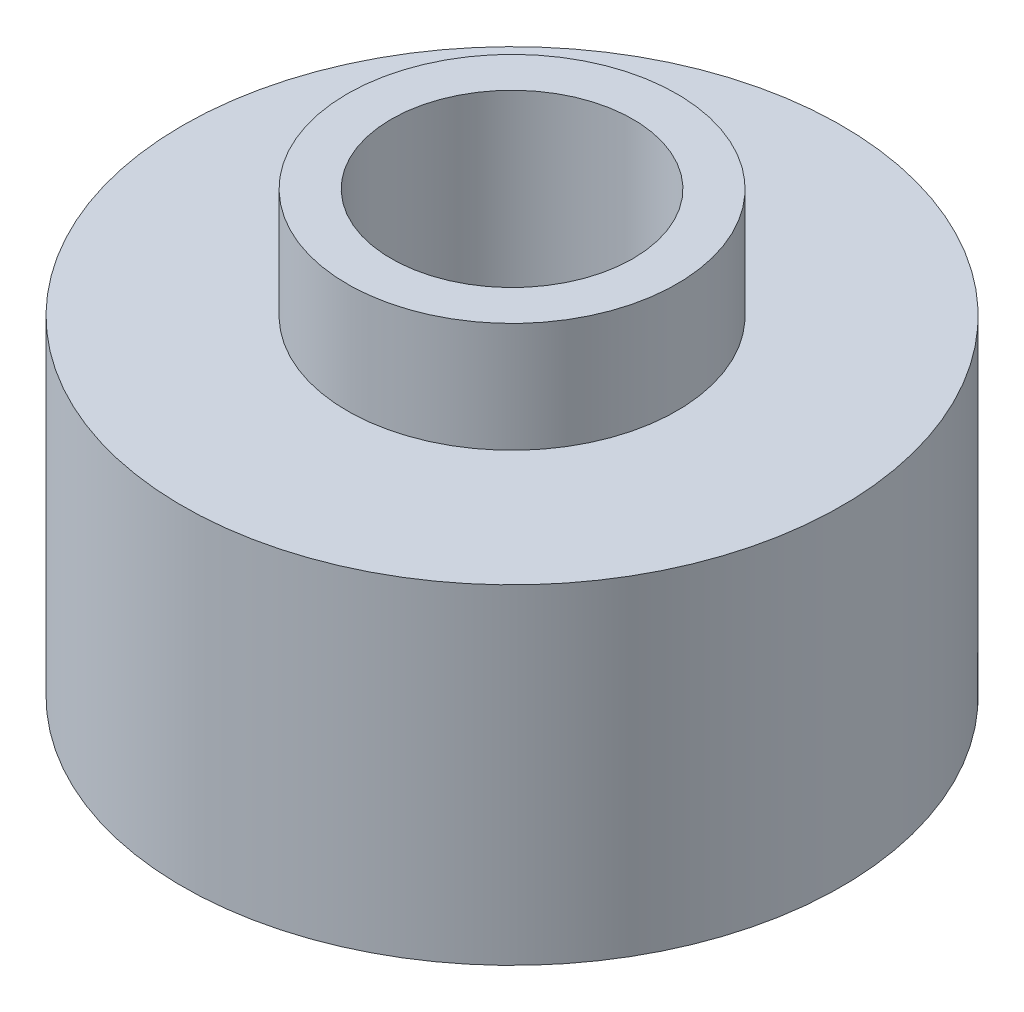
ISO-10303-21;
HEADER;
FILE_DESCRIPTION(('STEP AP214'),'2;1');
FILE_NAME('part.step','',(''),(''),'','','');
FILE_SCHEMA(('AUTOMOTIVE_DESIGN { 1 0 10303 214 1 1 1 1 }'));
ENDSEC;
DATA;
#1=APPLICATION_CONTEXT('core data for automotive mechanical design processes');
#2=APPLICATION_PROTOCOL_DEFINITION('international standard','automotive_design',2000,#1);
#3=PRODUCT_CONTEXT('',#1,'mechanical');
#4=PRODUCT('Part','Part','',(#3));
#5=PRODUCT_RELATED_PRODUCT_CATEGORY('part','',(#4));
#6=PRODUCT_DEFINITION_FORMATION('','',#4);
#7=PRODUCT_DEFINITION_CONTEXT('part definition',#1,'design');
#8=PRODUCT_DEFINITION('design','',#6,#7);
#9=PRODUCT_DEFINITION_SHAPE('','',#8);
#10=(LENGTH_UNIT() NAMED_UNIT(*) SI_UNIT(.MILLI.,.METRE.));
#11=(NAMED_UNIT(*) PLANE_ANGLE_UNIT() SI_UNIT($,.RADIAN.));
#12=(NAMED_UNIT(*) SI_UNIT($,.STERADIAN.) SOLID_ANGLE_UNIT());
#13=UNCERTAINTY_MEASURE_WITH_UNIT(LENGTH_MEASURE(1.E-05),#10,'distance_accuracy_value','');
#14=(GEOMETRIC_REPRESENTATION_CONTEXT(3) GLOBAL_UNCERTAINTY_ASSIGNED_CONTEXT((#13)) GLOBAL_UNIT_ASSIGNED_CONTEXT((#10,
#11,#12)) REPRESENTATION_CONTEXT('',''));
#15=CARTESIAN_POINT('',(0.,0.,0.));
#16=DIRECTION('',(0.,0.,1.));
#17=DIRECTION('',(1.,0.,0.));
#18=AXIS2_PLACEMENT_3D('',#15,#16,#17);
#19=CARTESIAN_POINT('',(0.,0.,0.));
#20=DIRECTION('',(0.,1.,0.));
#21=DIRECTION('',(-1.,0.,0.));
#22=AXIS2_PLACEMENT_3D('',#19,#20,#21);
#23=PLANE('',#22);
#24=CARTESIAN_POINT('',(0.,0.,0.));
#25=DIRECTION('',(0.,1.,0.));
#26=DIRECTION('',(-1.,0.,0.));
#27=AXIS2_PLACEMENT_3D('',#24,#25,#26);
#28=CIRCLE('',#27,3.4925);
#29=CARTESIAN_POINT('',(-3.4925,0.,0.));
#30=VERTEX_POINT('',#29);
#31=EDGE_CURVE('E63',#30,#30,#28,.T.);
#32=ORIENTED_EDGE('',*,*,#31,.T.);
#33=EDGE_LOOP('',(#32));
#34=FACE_BOUND('',#33,.T.);
#35=CARTESIAN_POINT('',(0.,0.,0.));
#36=DIRECTION('',(0.,1.,0.));
#37=DIRECTION('',(-1.,0.,0.));
#38=AXIS2_PLACEMENT_3D('',#35,#36,#37);
#39=CIRCLE('',#38,9.525);
#40=CARTESIAN_POINT('',(-9.525,0.,0.));
#41=VERTEX_POINT('',#40);
#42=EDGE_CURVE('E10',#41,#41,#39,.T.);
#43=ORIENTED_EDGE('',*,*,#42,.F.);
#44=EDGE_LOOP('',(#43));
#45=FACE_BOUND('',#44,.T.);
#46=ADVANCED_FACE('F40',(#34,#45),#23,.F.);
#47=CARTESIAN_POINT('',(0.,12.7,0.));
#48=DIRECTION('',(0.,1.,0.));
#49=DIRECTION('',(-1.,0.,0.));
#50=AXIS2_PLACEMENT_3D('',#47,#48,#49);
#51=CYLINDRICAL_SURFACE('',#50,9.525);
#52=CARTESIAN_POINT('',(0.,9.525,0.));
#53=DIRECTION('',(0.,1.,0.));
#54=DIRECTION('',(-1.,0.,0.));
#55=AXIS2_PLACEMENT_3D('',#52,#53,#54);
#56=CIRCLE('',#55,9.525);
#57=CARTESIAN_POINT('',(-9.525,9.525,0.));
#58=VERTEX_POINT('',#57);
#59=EDGE_CURVE('E47',#58,#58,#56,.T.);
#60=ORIENTED_EDGE('',*,*,#59,.F.);
#61=EDGE_LOOP('',(#60));
#62=FACE_BOUND('',#61,.T.);
#63=ORIENTED_EDGE('',*,*,#42,.T.);
#64=EDGE_LOOP('',(#63));
#65=FACE_BOUND('',#64,.T.);
#66=ADVANCED_FACE('F94',(#62,#65),#51,.T.);
#67=CARTESIAN_POINT('',(9.525,9.525,0.));
#68=DIRECTION('',(0.,-1.,0.));
#69=DIRECTION('',(1.,0.,0.));
#70=AXIS2_PLACEMENT_3D('',#67,#68,#69);
#71=PLANE('',#70);
#72=CARTESIAN_POINT('',(0.,9.525,0.));
#73=DIRECTION('',(0.,1.,0.));
#74=DIRECTION('',(-1.,0.,0.));
#75=AXIS2_PLACEMENT_3D('',#72,#73,#74);
#76=CIRCLE('',#75,4.7625);
#77=CARTESIAN_POINT('',(-4.7625,9.525,0.));
#78=VERTEX_POINT('',#77);
#79=EDGE_CURVE('E52',#78,#78,#76,.T.);
#80=ORIENTED_EDGE('',*,*,#79,.F.);
#81=EDGE_LOOP('',(#80));
#82=FACE_BOUND('',#81,.T.);
#83=ORIENTED_EDGE('',*,*,#59,.T.);
#84=EDGE_LOOP('',(#83));
#85=FACE_BOUND('',#84,.T.);
#86=ADVANCED_FACE('F89',(#82,#85),#71,.F.);
#87=CARTESIAN_POINT('',(0.,12.7,0.));
#88=DIRECTION('',(0.,1.,0.));
#89=DIRECTION('',(-1.,0.,0.));
#90=AXIS2_PLACEMENT_3D('',#87,#88,#89);
#91=CYLINDRICAL_SURFACE('',#90,4.7625);
#92=CARTESIAN_POINT('',(0.,12.7,0.));
#93=DIRECTION('',(0.,1.,0.));
#94=DIRECTION('',(-1.,0.,0.));
#95=AXIS2_PLACEMENT_3D('',#92,#93,#94);
#96=CIRCLE('',#95,4.7625);
#97=CARTESIAN_POINT('',(-4.7625,12.7,0.));
#98=VERTEX_POINT('',#97);
#99=EDGE_CURVE('E57',#98,#98,#96,.T.);
#100=ORIENTED_EDGE('',*,*,#99,.F.);
#101=EDGE_LOOP('',(#100));
#102=FACE_BOUND('',#101,.T.);
#103=ORIENTED_EDGE('',*,*,#79,.T.);
#104=EDGE_LOOP('',(#103));
#105=FACE_BOUND('',#104,.T.);
#106=ADVANCED_FACE('F83',(#102,#105),#91,.T.);
#107=CARTESIAN_POINT('',(4.7625,12.7,0.));
#108=DIRECTION('',(0.,-1.,0.));
#109=DIRECTION('',(1.,0.,0.));
#110=AXIS2_PLACEMENT_3D('',#107,#108,#109);
#111=PLANE('',#110);
#112=CARTESIAN_POINT('',(0.,12.7,0.));
#113=DIRECTION('',(0.,1.,0.));
#114=DIRECTION('',(-1.,0.,0.));
#115=AXIS2_PLACEMENT_3D('',#112,#113,#114);
#116=CIRCLE('',#115,3.4925);
#117=CARTESIAN_POINT('',(-3.4925,12.7,0.));
#118=VERTEX_POINT('',#117);
#119=EDGE_CURVE('E64',#118,#118,#116,.T.);
#120=ORIENTED_EDGE('',*,*,#119,.F.);
#121=EDGE_LOOP('',(#120));
#122=FACE_BOUND('',#121,.T.);
#123=ORIENTED_EDGE('',*,*,#99,.T.);
#124=EDGE_LOOP('',(#123));
#125=FACE_BOUND('',#124,.T.);
#126=ADVANCED_FACE('F77',(#122,#125),#111,.F.);
#127=CARTESIAN_POINT('',(0.,0.,0.));
#128=DIRECTION('',(0.,1.,0.));
#129=DIRECTION('',(-1.,0.,0.));
#130=AXIS2_PLACEMENT_3D('',#127,#128,#129);
#131=CYLINDRICAL_SURFACE('',#130,3.4925);
#132=ORIENTED_EDGE('',*,*,#31,.F.);
#133=EDGE_LOOP('',(#132));
#134=FACE_BOUND('',#133,.T.);
#135=ORIENTED_EDGE('',*,*,#119,.T.);
#136=EDGE_LOOP('',(#135));
#137=FACE_BOUND('',#136,.T.);
#138=ADVANCED_FACE('F74',(#134,#137),#131,.F.);
#139=CLOSED_SHELL('',(#46,#66,#86,#106,#126,#138));
#140=MANIFOLD_SOLID_BREP('B2',#139);
#141=ADVANCED_BREP_SHAPE_REPRESENTATION('',(#18,#140),#14);
#142=SHAPE_DEFINITION_REPRESENTATION(#9,#141);
ENDSEC;
END-ISO-10303-21;
